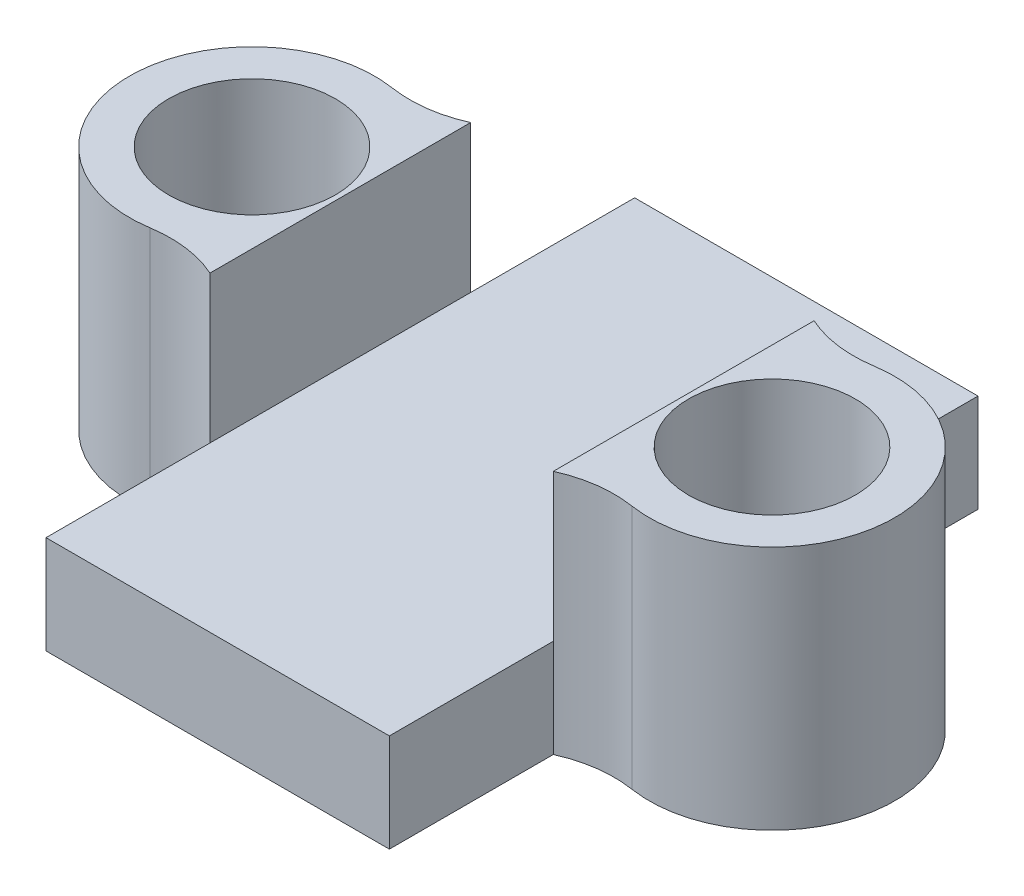
ISO-10303-21;
HEADER;
FILE_DESCRIPTION(('STEP AP214'),'2;1');
FILE_NAME('part.step','',(''),(''),'','','');
FILE_SCHEMA(('AUTOMOTIVE_DESIGN { 1 0 10303 214 1 1 1 1 }'));
ENDSEC;
DATA;
#1=APPLICATION_CONTEXT('core data for automotive mechanical design processes');
#2=APPLICATION_PROTOCOL_DEFINITION('international standard','automotive_design',2000,#1);
#3=PRODUCT_CONTEXT('',#1,'mechanical');
#4=PRODUCT('Part','Part','',(#3));
#5=PRODUCT_RELATED_PRODUCT_CATEGORY('part','',(#4));
#6=PRODUCT_DEFINITION_FORMATION('','',#4);
#7=PRODUCT_DEFINITION_CONTEXT('part definition',#1,'design');
#8=PRODUCT_DEFINITION('design','',#6,#7);
#9=PRODUCT_DEFINITION_SHAPE('','',#8);
#10=(LENGTH_UNIT() NAMED_UNIT(*) SI_UNIT(.MILLI.,.METRE.));
#11=(NAMED_UNIT(*) PLANE_ANGLE_UNIT() SI_UNIT($,.RADIAN.));
#12=(NAMED_UNIT(*) SI_UNIT($,.STERADIAN.) SOLID_ANGLE_UNIT());
#13=UNCERTAINTY_MEASURE_WITH_UNIT(LENGTH_MEASURE(1.E-05),#10,'distance_accuracy_value','');
#14=(GEOMETRIC_REPRESENTATION_CONTEXT(3) GLOBAL_UNCERTAINTY_ASSIGNED_CONTEXT((#13)) GLOBAL_UNIT_ASSIGNED_CONTEXT((#10,
#11,#12)) REPRESENTATION_CONTEXT('',''));
#15=CARTESIAN_POINT('',(0.,0.,0.));
#16=DIRECTION('',(0.,0.,1.));
#17=DIRECTION('',(1.,0.,0.));
#18=AXIS2_PLACEMENT_3D('',#15,#16,#17);
#19=CARTESIAN_POINT('',(4.52192962377324,2.,-4.93908964179011));
#20=DIRECTION('',(0.,1.,0.));
#21=DIRECTION('',(0.,0.,1.));
#22=AXIS2_PLACEMENT_3D('',#19,#20,#21);
#23=PLANE('',#22);
#24=DIRECTION('',(0.,0.,1.));
#25=VECTOR('',#24,1.);
#26=CARTESIAN_POINT('',(-3.5,2.,-6.));
#27=LINE('',#26,#25);
#28=CARTESIAN_POINT('',(-3.5,2.,-6.));
#29=VERTEX_POINT('',#28);
#30=CARTESIAN_POINT('',(-3.5,2.,-2.65749812619081));
#31=VERTEX_POINT('',#30);
#32=EDGE_CURVE('E138',#29,#31,#27,.T.);
#33=ORIENTED_EDGE('',*,*,#32,.T.);
#34=DIRECTION('',(0.,0.,-1.));
#35=VECTOR('',#34,1.);
#36=CARTESIAN_POINT('',(-3.5,2.,0.));
#37=LINE('',#36,#35);
#38=CARTESIAN_POINT('',(-3.5,2.,2.65749812619081));
#39=VERTEX_POINT('',#38);
#40=EDGE_CURVE('E133',#39,#31,#37,.T.);
#41=ORIENTED_EDGE('',*,*,#40,.F.);
#42=DIRECTION('',(0.,0.,1.));
#43=VECTOR('',#42,1.);
#44=CARTESIAN_POINT('',(-3.5,2.,6.));
#45=LINE('',#44,#43);
#46=CARTESIAN_POINT('',(-3.5,2.,6.));
#47=VERTEX_POINT('',#46);
#48=EDGE_CURVE('E125',#39,#47,#45,.T.);
#49=ORIENTED_EDGE('',*,*,#48,.T.);
#50=DIRECTION('',(1.,0.,0.));
#51=VECTOR('',#50,1.);
#52=CARTESIAN_POINT('',(-3.5,2.,6.));
#53=LINE('',#52,#51);
#54=CARTESIAN_POINT('',(3.5,2.,6.));
#55=VERTEX_POINT('',#54);
#56=EDGE_CURVE('E129',#47,#55,#53,.T.);
#57=ORIENTED_EDGE('',*,*,#56,.T.);
#58=DIRECTION('',(0.,0.,-1.));
#59=VECTOR('',#58,1.);
#60=CARTESIAN_POINT('',(3.5,2.,6.));
#61=LINE('',#60,#59);
#62=CARTESIAN_POINT('',(3.5,2.,2.65749812619081));
#63=VERTEX_POINT('',#62);
#64=EDGE_CURVE('E153',#55,#63,#61,.T.);
#65=ORIENTED_EDGE('',*,*,#64,.T.);
#66=DIRECTION('',(0.,0.,-1.));
#67=VECTOR('',#66,1.);
#68=CARTESIAN_POINT('',(3.5,2.,0.));
#69=LINE('',#68,#67);
#70=CARTESIAN_POINT('',(3.5,2.,-2.65749812619081));
#71=VERTEX_POINT('',#70);
#72=EDGE_CURVE('E245',#63,#71,#69,.T.);
#73=ORIENTED_EDGE('',*,*,#72,.T.);
#74=DIRECTION('',(0.,0.,-1.));
#75=VECTOR('',#74,1.);
#76=CARTESIAN_POINT('',(3.5,2.,-6.));
#77=LINE('',#76,#75);
#78=CARTESIAN_POINT('',(3.5,2.,-6.));
#79=VERTEX_POINT('',#78);
#80=EDGE_CURVE('E182',#71,#79,#77,.T.);
#81=ORIENTED_EDGE('',*,*,#80,.T.);
#82=DIRECTION('',(-1.,0.,0.));
#83=VECTOR('',#82,1.);
#84=CARTESIAN_POINT('',(-3.5,2.,-6.));
#85=LINE('',#84,#83);
#86=EDGE_CURVE('E112',#79,#29,#85,.T.);
#87=ORIENTED_EDGE('',*,*,#86,.T.);
#88=EDGE_LOOP('',(#33,#41,#49,#57,#65,#73,#81,#87));
#89=FACE_BOUND('',#88,.T.);
#90=ADVANCED_FACE('F37',(#89),#23,.T.);
#91=CARTESIAN_POINT('',(4.52192962377324,0.,-4.93908964179011));
#92=DIRECTION('',(0.,1.,0.));
#93=DIRECTION('',(0.,0.,1.));
#94=AXIS2_PLACEMENT_3D('',#91,#92,#93);
#95=PLANE('',#94);
#96=DIRECTION('',(0.,0.,-1.));
#97=VECTOR('',#96,1.);
#98=CARTESIAN_POINT('',(3.5,0.,-6.));
#99=LINE('',#98,#97);
#100=CARTESIAN_POINT('',(3.5,0.,-2.65749812619081));
#101=VERTEX_POINT('',#100);
#102=CARTESIAN_POINT('',(3.5,0.,-6.));
#103=VERTEX_POINT('',#102);
#104=EDGE_CURVE('E159',#101,#103,#99,.T.);
#105=ORIENTED_EDGE('',*,*,#104,.F.);
#106=CARTESIAN_POINT('',(4.52192962377324,0.,-4.93908964179011));
#107=DIRECTION('',(0.,-1.,0.));
#108=DIRECTION('',(0.,0.,1.));
#109=AXIS2_PLACEMENT_3D('',#106,#107,#108);
#110=CIRCLE('',#109,2.5);
#111=CARTESIAN_POINT('',(4.91096481188662,0.,-2.46954482089505));
#112=VERTEX_POINT('',#111);
#113=EDGE_CURVE('E104',#112,#101,#110,.T.);
#114=ORIENTED_EDGE('',*,*,#113,.F.);
#115=CARTESIAN_POINT('',(5.3,0.,0.));
#116=DIRECTION('',(0.,1.,0.));
#117=DIRECTION('',(0.,0.,1.));
#118=AXIS2_PLACEMENT_3D('',#115,#116,#117);
#119=CIRCLE('',#118,2.5);
#120=CARTESIAN_POINT('',(4.91096481188662,0.,2.46954482089505));
#121=VERTEX_POINT('',#120);
#122=EDGE_CURVE('E97',#121,#112,#119,.T.);
#123=ORIENTED_EDGE('',*,*,#122,.F.);
#124=CARTESIAN_POINT('',(4.52192962377324,0.,4.93908964179011));
#125=DIRECTION('',(0.,-1.,0.));
#126=DIRECTION('',(0.,0.,-1.));
#127=AXIS2_PLACEMENT_3D('',#124,#125,#126);
#128=CIRCLE('',#127,2.5);
#129=CARTESIAN_POINT('',(3.5,0.,2.65749812619081));
#130=VERTEX_POINT('',#129);
#131=EDGE_CURVE('E178',#130,#121,#128,.T.);
#132=ORIENTED_EDGE('',*,*,#131,.F.);
#133=DIRECTION('',(0.,0.,-1.));
#134=VECTOR('',#133,1.);
#135=CARTESIAN_POINT('',(3.5,0.,6.));
#136=LINE('',#135,#134);
#137=CARTESIAN_POINT('',(3.5,0.,6.));
#138=VERTEX_POINT('',#137);
#139=EDGE_CURVE('E176',#138,#130,#136,.T.);
#140=ORIENTED_EDGE('',*,*,#139,.F.);
#141=DIRECTION('',(1.,0.,0.));
#142=VECTOR('',#141,1.);
#143=CARTESIAN_POINT('',(-3.5,0.,6.));
#144=LINE('',#143,#142);
#145=CARTESIAN_POINT('',(-3.5,0.,6.));
#146=VERTEX_POINT('',#145);
#147=EDGE_CURVE('E174',#146,#138,#144,.T.);
#148=ORIENTED_EDGE('',*,*,#147,.F.);
#149=DIRECTION('',(0.,0.,1.));
#150=VECTOR('',#149,1.);
#151=CARTESIAN_POINT('',(-3.5,0.,6.));
#152=LINE('',#151,#150);
#153=CARTESIAN_POINT('',(-3.5,0.,2.65749812619081));
#154=VERTEX_POINT('',#153);
#155=EDGE_CURVE('E144',#154,#146,#152,.T.);
#156=ORIENTED_EDGE('',*,*,#155,.F.);
#157=CARTESIAN_POINT('',(-4.52192962377324,0.,4.93908964179011));
#158=DIRECTION('',(0.,-1.,0.));
#159=DIRECTION('',(0.,0.,1.));
#160=AXIS2_PLACEMENT_3D('',#157,#158,#159);
#161=CIRCLE('',#160,2.5);
#162=CARTESIAN_POINT('',(-4.91096481188662,0.,2.46954482089505));
#163=VERTEX_POINT('',#162);
#164=EDGE_CURVE('E171',#163,#154,#161,.T.);
#165=ORIENTED_EDGE('',*,*,#164,.F.);
#166=CARTESIAN_POINT('',(-5.3,0.,0.));
#167=DIRECTION('',(0.,1.,0.));
#168=DIRECTION('',(0.,0.,-1.));
#169=AXIS2_PLACEMENT_3D('',#166,#167,#168);
#170=CIRCLE('',#169,2.5);
#171=CARTESIAN_POINT('',(-4.91096481188662,0.,-2.46954482089505));
#172=VERTEX_POINT('',#171);
#173=EDGE_CURVE('E169',#172,#163,#170,.T.);
#174=ORIENTED_EDGE('',*,*,#173,.F.);
#175=CARTESIAN_POINT('',(-4.52192962377324,0.,-4.93908964179011));
#176=DIRECTION('',(0.,-1.,0.));
#177=DIRECTION('',(0.,0.,-1.));
#178=AXIS2_PLACEMENT_3D('',#175,#176,#177);
#179=CIRCLE('',#178,2.5);
#180=CARTESIAN_POINT('',(-3.5,0.,-2.65749812619081));
#181=VERTEX_POINT('',#180);
#182=EDGE_CURVE('E167',#181,#172,#179,.T.);
#183=ORIENTED_EDGE('',*,*,#182,.F.);
#184=DIRECTION('',(0.,0.,1.));
#185=VECTOR('',#184,1.);
#186=CARTESIAN_POINT('',(-3.5,0.,-6.));
#187=LINE('',#186,#185);
#188=CARTESIAN_POINT('',(-3.5,0.,-6.));
#189=VERTEX_POINT('',#188);
#190=EDGE_CURVE('E165',#189,#181,#187,.T.);
#191=ORIENTED_EDGE('',*,*,#190,.F.);
#192=DIRECTION('',(-1.,0.,0.));
#193=VECTOR('',#192,1.);
#194=CARTESIAN_POINT('',(-3.5,0.,-6.));
#195=LINE('',#194,#193);
#196=EDGE_CURVE('E162',#103,#189,#195,.T.);
#197=ORIENTED_EDGE('',*,*,#196,.F.);
#198=EDGE_LOOP('',(#105,#114,#123,#132,#140,#148,#156,#165,#174,#183,#191,#197));
#199=FACE_BOUND('',#198,.T.);
#200=CARTESIAN_POINT('',(5.3,0.,0.));
#201=DIRECTION('',(0.,1.,0.));
#202=DIRECTION('',(0.,0.,1.));
#203=AXIS2_PLACEMENT_3D('',#200,#201,#202);
#204=CIRCLE('',#203,1.7);
#205=CARTESIAN_POINT('',(5.3,0.,1.7));
#206=VERTEX_POINT('',#205);
#207=EDGE_CURVE('E163',#206,#206,#204,.T.);
#208=ORIENTED_EDGE('',*,*,#207,.T.);
#209=EDGE_LOOP('',(#208));
#210=FACE_BOUND('',#209,.T.);
#211=CARTESIAN_POINT('',(-5.3,0.,0.));
#212=DIRECTION('',(0.,1.,0.));
#213=DIRECTION('',(0.,0.,-1.));
#214=AXIS2_PLACEMENT_3D('',#211,#212,#213);
#215=CIRCLE('',#214,1.7);
#216=CARTESIAN_POINT('',(-5.3,0.,-1.7));
#217=VERTEX_POINT('',#216);
#218=EDGE_CURVE('E265',#217,#217,#215,.T.);
#219=ORIENTED_EDGE('',*,*,#218,.T.);
#220=EDGE_LOOP('',(#219));
#221=FACE_BOUND('',#220,.T.);
#222=ADVANCED_FACE('F210',(#199,#210,#221),#95,.F.);
#223=CARTESIAN_POINT('',(3.5,2.,-6.));
#224=DIRECTION('',(-1.,0.,0.));
#225=DIRECTION('',(0.,0.,1.));
#226=AXIS2_PLACEMENT_3D('',#223,#224,#225);
#227=PLANE('',#226);
#228=ORIENTED_EDGE('',*,*,#104,.T.);
#229=DIRECTION('',(0.,-1.,0.));
#230=VECTOR('',#229,1.);
#231=CARTESIAN_POINT('',(3.5,2.,-6.));
#232=LINE('',#231,#230);
#233=EDGE_CURVE('E11',#79,#103,#232,.T.);
#234=ORIENTED_EDGE('',*,*,#233,.F.);
#235=ORIENTED_EDGE('',*,*,#80,.F.);
#236=DIRECTION('',(0.,-1.,0.));
#237=VECTOR('',#236,1.);
#238=CARTESIAN_POINT('',(3.5,2.,-2.65749812619081));
#239=LINE('',#238,#237);
#240=EDGE_CURVE('E155',#71,#101,#239,.T.);
#241=ORIENTED_EDGE('',*,*,#240,.T.);
#242=EDGE_LOOP('',(#228,#234,#235,#241));
#243=FACE_BOUND('',#242,.T.);
#244=ADVANCED_FACE('F39',(#243),#227,.F.);
#245=CARTESIAN_POINT('',(-3.5,2.,-6.));
#246=DIRECTION('',(0.,0.,1.));
#247=DIRECTION('',(1.,0.,0.));
#248=AXIS2_PLACEMENT_3D('',#245,#246,#247);
#249=PLANE('',#248);
#250=ORIENTED_EDGE('',*,*,#196,.T.);
#251=DIRECTION('',(0.,-1.,0.));
#252=VECTOR('',#251,1.);
#253=CARTESIAN_POINT('',(-3.5,2.,-6.));
#254=LINE('',#253,#252);
#255=EDGE_CURVE('E46',#29,#189,#254,.T.);
#256=ORIENTED_EDGE('',*,*,#255,.F.);
#257=ORIENTED_EDGE('',*,*,#86,.F.);
#258=ORIENTED_EDGE('',*,*,#233,.T.);
#259=EDGE_LOOP('',(#250,#256,#257,#258));
#260=FACE_BOUND('',#259,.T.);
#261=ADVANCED_FACE('F336',(#260),#249,.F.);
#262=CARTESIAN_POINT('',(-3.5,2.,-6.));
#263=DIRECTION('',(1.,0.,0.));
#264=DIRECTION('',(0.,0.,-1.));
#265=AXIS2_PLACEMENT_3D('',#262,#263,#264);
#266=PLANE('',#265);
#267=ORIENTED_EDGE('',*,*,#190,.T.);
#268=DIRECTION('',(0.,-1.,0.));
#269=VECTOR('',#268,1.);
#270=CARTESIAN_POINT('',(-3.5,2.,-2.65749812619081));
#271=LINE('',#270,#269);
#272=EDGE_CURVE('E199',#31,#181,#271,.T.);
#273=ORIENTED_EDGE('',*,*,#272,.F.);
#274=ORIENTED_EDGE('',*,*,#32,.F.);
#275=ORIENTED_EDGE('',*,*,#255,.T.);
#276=EDGE_LOOP('',(#267,#273,#274,#275));
#277=FACE_BOUND('',#276,.T.);
#278=ADVANCED_FACE('F205',(#277),#266,.F.);
#279=CARTESIAN_POINT('',(-4.52192962377324,2.,-4.93908964179011));
#280=DIRECTION('',(0.,-1.,0.));
#281=DIRECTION('',(0.,0.,-1.));
#282=AXIS2_PLACEMENT_3D('',#279,#280,#281);
#283=CYLINDRICAL_SURFACE('',#282,2.5);
#284=ORIENTED_EDGE('',*,*,#182,.T.);
#285=DIRECTION('',(0.,-1.,0.));
#286=VECTOR('',#285,1.);
#287=CARTESIAN_POINT('',(-4.91096481188662,2.,-2.46954482089505));
#288=LINE('',#287,#286);
#289=CARTESIAN_POINT('',(-4.91096481188661,5.,-2.46954482089505));
#290=VERTEX_POINT('',#289);
#291=EDGE_CURVE('E196',#290,#172,#288,.T.);
#292=ORIENTED_EDGE('',*,*,#291,.F.);
#293=CARTESIAN_POINT('',(-4.52192962377324,5.,-4.93908964179011));
#294=DIRECTION('',(0.,1.,0.));
#295=DIRECTION('',(0.,0.,1.));
#296=AXIS2_PLACEMENT_3D('',#293,#294,#295);
#297=CIRCLE('',#296,2.5);
#298=CARTESIAN_POINT('',(-3.5,5.,-2.65749812619081));
#299=VERTEX_POINT('',#298);
#300=EDGE_CURVE('E234',#299,#290,#297,.F.);
#301=ORIENTED_EDGE('',*,*,#300,.F.);
#302=DIRECTION('',(0.,-1.,0.));
#303=VECTOR('',#302,1.);
#304=CARTESIAN_POINT('',(-3.5,5.,-2.65749812619081));
#305=LINE('',#304,#303);
#306=EDGE_CURVE('E233',#299,#31,#305,.T.);
#307=ORIENTED_EDGE('',*,*,#306,.T.);
#308=ORIENTED_EDGE('',*,*,#272,.T.);
#309=EDGE_LOOP('',(#284,#292,#301,#307,#308));
#310=FACE_BOUND('',#309,.T.);
#311=ADVANCED_FACE('F216',(#310),#283,.F.);
#312=CARTESIAN_POINT('',(-5.3,2.,0.));
#313=DIRECTION('',(0.,-1.,0.));
#314=DIRECTION('',(0.,0.,-1.));
#315=AXIS2_PLACEMENT_3D('',#312,#313,#314);
#316=CYLINDRICAL_SURFACE('',#315,2.5);
#317=ORIENTED_EDGE('',*,*,#173,.T.);
#318=DIRECTION('',(0.,-1.,0.));
#319=VECTOR('',#318,1.);
#320=CARTESIAN_POINT('',(-4.91096481188662,2.,2.46954482089505));
#321=LINE('',#320,#319);
#322=CARTESIAN_POINT('',(-4.91096481188662,5.,2.46954482089505));
#323=VERTEX_POINT('',#322);
#324=EDGE_CURVE('E193',#323,#163,#321,.T.);
#325=ORIENTED_EDGE('',*,*,#324,.F.);
#326=CARTESIAN_POINT('',(-5.3,5.,0.));
#327=DIRECTION('',(0.,1.,0.));
#328=DIRECTION('',(0.,0.,1.));
#329=AXIS2_PLACEMENT_3D('',#326,#327,#328);
#330=CIRCLE('',#329,2.5);
#331=EDGE_CURVE('E226',#290,#323,#330,.T.);
#332=ORIENTED_EDGE('',*,*,#331,.F.);
#333=ORIENTED_EDGE('',*,*,#291,.T.);
#334=EDGE_LOOP('',(#317,#325,#332,#333));
#335=FACE_BOUND('',#334,.T.);
#336=ADVANCED_FACE('F223',(#335),#316,.T.);
#337=CARTESIAN_POINT('',(-4.52192962377324,2.,4.93908964179011));
#338=DIRECTION('',(0.,-1.,0.));
#339=DIRECTION('',(0.,0.,-1.));
#340=AXIS2_PLACEMENT_3D('',#337,#338,#339);
#341=CYLINDRICAL_SURFACE('',#340,2.5);
#342=ORIENTED_EDGE('',*,*,#164,.T.);
#343=DIRECTION('',(0.,-1.,0.));
#344=VECTOR('',#343,1.);
#345=CARTESIAN_POINT('',(-3.5,2.,2.65749812619081));
#346=LINE('',#345,#344);
#347=EDGE_CURVE('E147',#39,#154,#346,.T.);
#348=ORIENTED_EDGE('',*,*,#347,.F.);
#349=DIRECTION('',(0.,-1.,0.));
#350=VECTOR('',#349,1.);
#351=CARTESIAN_POINT('',(-3.5,5.,2.65749812619081));
#352=LINE('',#351,#350);
#353=CARTESIAN_POINT('',(-3.5,5.,2.65749812619081));
#354=VERTEX_POINT('',#353);
#355=EDGE_CURVE('E236',#354,#39,#352,.T.);
#356=ORIENTED_EDGE('',*,*,#355,.F.);
#357=CARTESIAN_POINT('',(-4.52192962377324,5.,4.93908964179011));
#358=DIRECTION('',(0.,1.,0.));
#359=DIRECTION('',(0.,0.,1.));
#360=AXIS2_PLACEMENT_3D('',#357,#358,#359);
#361=CIRCLE('',#360,2.5);
#362=EDGE_CURVE('E280',#323,#354,#361,.F.);
#363=ORIENTED_EDGE('',*,*,#362,.F.);
#364=ORIENTED_EDGE('',*,*,#324,.T.);
#365=EDGE_LOOP('',(#342,#348,#356,#363,#364));
#366=FACE_BOUND('',#365,.T.);
#367=ADVANCED_FACE('F327',(#366),#341,.F.);
#368=CARTESIAN_POINT('',(-3.5,2.,6.));
#369=DIRECTION('',(1.,0.,0.));
#370=DIRECTION('',(0.,0.,-1.));
#371=AXIS2_PLACEMENT_3D('',#368,#369,#370);
#372=PLANE('',#371);
#373=ORIENTED_EDGE('',*,*,#155,.T.);
#374=DIRECTION('',(0.,-1.,0.));
#375=VECTOR('',#374,1.);
#376=CARTESIAN_POINT('',(-3.5,2.,6.));
#377=LINE('',#376,#375);
#378=EDGE_CURVE('E141',#47,#146,#377,.T.);
#379=ORIENTED_EDGE('',*,*,#378,.F.);
#380=ORIENTED_EDGE('',*,*,#48,.F.);
#381=ORIENTED_EDGE('',*,*,#347,.T.);
#382=EDGE_LOOP('',(#373,#379,#380,#381));
#383=FACE_BOUND('',#382,.T.);
#384=ADVANCED_FACE('F142',(#383),#372,.F.);
#385=CARTESIAN_POINT('',(-3.5,2.,6.));
#386=DIRECTION('',(0.,0.,-1.));
#387=DIRECTION('',(-1.,0.,0.));
#388=AXIS2_PLACEMENT_3D('',#385,#386,#387);
#389=PLANE('',#388);
#390=ORIENTED_EDGE('',*,*,#147,.T.);
#391=DIRECTION('',(0.,-1.,0.));
#392=VECTOR('',#391,1.);
#393=CARTESIAN_POINT('',(3.5,2.,6.));
#394=LINE('',#393,#392);
#395=EDGE_CURVE('E148',#55,#138,#394,.T.);
#396=ORIENTED_EDGE('',*,*,#395,.F.);
#397=ORIENTED_EDGE('',*,*,#56,.F.);
#398=ORIENTED_EDGE('',*,*,#378,.T.);
#399=EDGE_LOOP('',(#390,#396,#397,#398));
#400=FACE_BOUND('',#399,.T.);
#401=ADVANCED_FACE('F150',(#400),#389,.F.);
#402=CARTESIAN_POINT('',(3.5,2.,6.));
#403=DIRECTION('',(-1.,0.,0.));
#404=DIRECTION('',(0.,0.,1.));
#405=AXIS2_PLACEMENT_3D('',#402,#403,#404);
#406=PLANE('',#405);
#407=ORIENTED_EDGE('',*,*,#139,.T.);
#408=DIRECTION('',(0.,-1.,0.));
#409=VECTOR('',#408,1.);
#410=CARTESIAN_POINT('',(3.5,2.,2.65749812619081));
#411=LINE('',#410,#409);
#412=EDGE_CURVE('E188',#63,#130,#411,.T.);
#413=ORIENTED_EDGE('',*,*,#412,.F.);
#414=ORIENTED_EDGE('',*,*,#64,.F.);
#415=ORIENTED_EDGE('',*,*,#395,.T.);
#416=EDGE_LOOP('',(#407,#413,#414,#415));
#417=FACE_BOUND('',#416,.T.);
#418=ADVANCED_FACE('F318',(#417),#406,.F.);
#419=CARTESIAN_POINT('',(4.52192962377324,2.,4.93908964179011));
#420=DIRECTION('',(0.,-1.,0.));
#421=DIRECTION('',(0.,0.,-1.));
#422=AXIS2_PLACEMENT_3D('',#419,#420,#421);
#423=CYLINDRICAL_SURFACE('',#422,2.5);
#424=ORIENTED_EDGE('',*,*,#131,.T.);
#425=DIRECTION('',(0.,-1.,0.));
#426=VECTOR('',#425,1.);
#427=CARTESIAN_POINT('',(4.91096481188662,2.,2.46954482089505));
#428=LINE('',#427,#426);
#429=CARTESIAN_POINT('',(4.91096481188662,5.,2.46954482089505));
#430=VERTEX_POINT('',#429);
#431=EDGE_CURVE('E186',#430,#121,#428,.T.);
#432=ORIENTED_EDGE('',*,*,#431,.F.);
#433=CARTESIAN_POINT('',(4.52192962377324,5.,4.93908964179011));
#434=DIRECTION('',(0.,1.,0.));
#435=DIRECTION('',(0.,0.,1.));
#436=AXIS2_PLACEMENT_3D('',#433,#434,#435);
#437=CIRCLE('',#436,2.5);
#438=CARTESIAN_POINT('',(3.5,5.,2.65749812619081));
#439=VERTEX_POINT('',#438);
#440=EDGE_CURVE('E248',#439,#430,#437,.F.);
#441=ORIENTED_EDGE('',*,*,#440,.F.);
#442=DIRECTION('',(0.,-1.,0.));
#443=VECTOR('',#442,1.);
#444=CARTESIAN_POINT('',(3.5,5.,2.65749812619081));
#445=LINE('',#444,#443);
#446=EDGE_CURVE('E262',#439,#63,#445,.T.);
#447=ORIENTED_EDGE('',*,*,#446,.T.);
#448=ORIENTED_EDGE('',*,*,#412,.T.);
#449=EDGE_LOOP('',(#424,#432,#441,#447,#448));
#450=FACE_BOUND('',#449,.T.);
#451=ADVANCED_FACE('F315',(#450),#423,.F.);
#452=CARTESIAN_POINT('',(5.3,2.,0.));
#453=DIRECTION('',(0.,-1.,0.));
#454=DIRECTION('',(0.,0.,-1.));
#455=AXIS2_PLACEMENT_3D('',#452,#453,#454);
#456=CYLINDRICAL_SURFACE('',#455,2.5);
#457=ORIENTED_EDGE('',*,*,#122,.T.);
#458=DIRECTION('',(0.,-1.,0.));
#459=VECTOR('',#458,1.);
#460=CARTESIAN_POINT('',(4.91096481188662,2.,-2.46954482089505));
#461=LINE('',#460,#459);
#462=CARTESIAN_POINT('',(4.91096481188662,5.,-2.46954482089505));
#463=VERTEX_POINT('',#462);
#464=EDGE_CURVE('E184',#463,#112,#461,.T.);
#465=ORIENTED_EDGE('',*,*,#464,.F.);
#466=CARTESIAN_POINT('',(5.3,5.,0.));
#467=DIRECTION('',(0.,1.,0.));
#468=DIRECTION('',(0.,0.,1.));
#469=AXIS2_PLACEMENT_3D('',#466,#467,#468);
#470=CIRCLE('',#469,2.5);
#471=EDGE_CURVE('E251',#430,#463,#470,.T.);
#472=ORIENTED_EDGE('',*,*,#471,.F.);
#473=ORIENTED_EDGE('',*,*,#431,.T.);
#474=EDGE_LOOP('',(#457,#465,#472,#473));
#475=FACE_BOUND('',#474,.T.);
#476=ADVANCED_FACE('F312',(#475),#456,.T.);
#477=CARTESIAN_POINT('',(4.52192962377324,2.,-4.93908964179011));
#478=DIRECTION('',(0.,-1.,0.));
#479=DIRECTION('',(0.,0.,-1.));
#480=AXIS2_PLACEMENT_3D('',#477,#478,#479);
#481=CYLINDRICAL_SURFACE('',#480,2.5);
#482=ORIENTED_EDGE('',*,*,#113,.T.);
#483=ORIENTED_EDGE('',*,*,#240,.F.);
#484=DIRECTION('',(0.,-1.,0.));
#485=VECTOR('',#484,1.);
#486=CARTESIAN_POINT('',(3.5,5.,-2.65749812619081));
#487=LINE('',#486,#485);
#488=CARTESIAN_POINT('',(3.5,5.,-2.65749812619081));
#489=VERTEX_POINT('',#488);
#490=EDGE_CURVE('E54',#489,#71,#487,.T.);
#491=ORIENTED_EDGE('',*,*,#490,.F.);
#492=CARTESIAN_POINT('',(4.52192962377324,5.,-4.93908964179011));
#493=DIRECTION('',(0.,1.,0.));
#494=DIRECTION('',(0.,0.,1.));
#495=AXIS2_PLACEMENT_3D('',#492,#493,#494);
#496=CIRCLE('',#495,2.5);
#497=EDGE_CURVE('E254',#463,#489,#496,.F.);
#498=ORIENTED_EDGE('',*,*,#497,.F.);
#499=ORIENTED_EDGE('',*,*,#464,.T.);
#500=EDGE_LOOP('',(#482,#483,#491,#498,#499));
#501=FACE_BOUND('',#500,.T.);
#502=ADVANCED_FACE('F299',(#501),#481,.F.);
#503=CARTESIAN_POINT('',(5.3,2.,0.));
#504=DIRECTION('',(0.,-1.,0.));
#505=DIRECTION('',(0.,0.,-1.));
#506=AXIS2_PLACEMENT_3D('',#503,#504,#505);
#507=CYLINDRICAL_SURFACE('',#506,1.7);
#508=ORIENTED_EDGE('',*,*,#207,.F.);
#509=EDGE_LOOP('',(#508));
#510=FACE_BOUND('',#509,.T.);
#511=CARTESIAN_POINT('',(5.3,5.,0.));
#512=DIRECTION('',(0.,1.,0.));
#513=DIRECTION('',(0.,0.,1.));
#514=AXIS2_PLACEMENT_3D('',#511,#512,#513);
#515=CIRCLE('',#514,1.7);
#516=CARTESIAN_POINT('',(5.3,5.,1.7));
#517=VERTEX_POINT('',#516);
#518=EDGE_CURVE('E257',#517,#517,#515,.F.);
#519=ORIENTED_EDGE('',*,*,#518,.F.);
#520=EDGE_LOOP('',(#519));
#521=FACE_BOUND('',#520,.T.);
#522=ADVANCED_FACE('F290',(#510,#521),#507,.F.);
#523=CARTESIAN_POINT('',(-5.3,2.,0.));
#524=DIRECTION('',(0.,-1.,0.));
#525=DIRECTION('',(0.,0.,-1.));
#526=AXIS2_PLACEMENT_3D('',#523,#524,#525);
#527=CYLINDRICAL_SURFACE('',#526,1.7);
#528=ORIENTED_EDGE('',*,*,#218,.F.);
#529=EDGE_LOOP('',(#528));
#530=FACE_BOUND('',#529,.T.);
#531=CARTESIAN_POINT('',(-5.3,5.,0.));
#532=DIRECTION('',(0.,1.,0.));
#533=DIRECTION('',(0.,0.,1.));
#534=AXIS2_PLACEMENT_3D('',#531,#532,#533);
#535=CIRCLE('',#534,1.7);
#536=CARTESIAN_POINT('',(-5.3,5.,1.7));
#537=VERTEX_POINT('',#536);
#538=EDGE_CURVE('E242',#537,#537,#535,.F.);
#539=ORIENTED_EDGE('',*,*,#538,.F.);
#540=EDGE_LOOP('',(#539));
#541=FACE_BOUND('',#540,.T.);
#542=ADVANCED_FACE('F287',(#530,#541),#527,.F.);
#543=CARTESIAN_POINT('',(3.5,5.,0.));
#544=DIRECTION('',(-1.,0.,0.));
#545=DIRECTION('',(0.,0.,1.));
#546=AXIS2_PLACEMENT_3D('',#543,#544,#545);
#547=PLANE('',#546);
#548=ORIENTED_EDGE('',*,*,#72,.F.);
#549=ORIENTED_EDGE('',*,*,#446,.F.);
#550=DIRECTION('',(0.,0.,-1.));
#551=VECTOR('',#550,1.);
#552=CARTESIAN_POINT('',(3.5,5.,0.));
#553=LINE('',#552,#551);
#554=EDGE_CURVE('E246',#439,#489,#553,.T.);
#555=ORIENTED_EDGE('',*,*,#554,.T.);
#556=ORIENTED_EDGE('',*,*,#490,.T.);
#557=EDGE_LOOP('',(#548,#549,#555,#556));
#558=FACE_BOUND('',#557,.T.);
#559=ADVANCED_FACE('F289',(#558),#547,.T.);
#560=CARTESIAN_POINT('',(0.,5.,0.));
#561=DIRECTION('',(0.,1.,0.));
#562=DIRECTION('',(0.,0.,1.));
#563=AXIS2_PLACEMENT_3D('',#560,#561,#562);
#564=PLANE('',#563);
#565=ORIENTED_EDGE('',*,*,#554,.F.);
#566=ORIENTED_EDGE('',*,*,#440,.T.);
#567=ORIENTED_EDGE('',*,*,#471,.T.);
#568=ORIENTED_EDGE('',*,*,#497,.T.);
#569=EDGE_LOOP('',(#565,#566,#567,#568));
#570=FACE_BOUND('',#569,.T.);
#571=ORIENTED_EDGE('',*,*,#518,.T.);
#572=EDGE_LOOP('',(#571));
#573=FACE_BOUND('',#572,.T.);
#574=ADVANCED_FACE('F297',(#570,#573),#564,.T.);
#575=CARTESIAN_POINT('',(-3.5,5.,0.));
#576=DIRECTION('',(-1.,0.,0.));
#577=DIRECTION('',(0.,0.,1.));
#578=AXIS2_PLACEMENT_3D('',#575,#576,#577);
#579=PLANE('',#578);
#580=ORIENTED_EDGE('',*,*,#40,.T.);
#581=ORIENTED_EDGE('',*,*,#306,.F.);
#582=DIRECTION('',(0.,0.,-1.));
#583=VECTOR('',#582,1.);
#584=CARTESIAN_POINT('',(-3.5,5.,0.));
#585=LINE('',#584,#583);
#586=EDGE_CURVE('E238',#354,#299,#585,.T.);
#587=ORIENTED_EDGE('',*,*,#586,.F.);
#588=ORIENTED_EDGE('',*,*,#355,.T.);
#589=EDGE_LOOP('',(#580,#581,#587,#588));
#590=FACE_BOUND('',#589,.T.);
#591=ADVANCED_FACE('F273',(#590),#579,.F.);
#592=CARTESIAN_POINT('',(0.,5.,0.));
#593=DIRECTION('',(0.,1.,0.));
#594=DIRECTION('',(0.,0.,1.));
#595=AXIS2_PLACEMENT_3D('',#592,#593,#594);
#596=PLANE('',#595);
#597=ORIENTED_EDGE('',*,*,#538,.T.);
#598=EDGE_LOOP('',(#597));
#599=FACE_BOUND('',#598,.T.);
#600=ORIENTED_EDGE('',*,*,#362,.T.);
#601=ORIENTED_EDGE('',*,*,#586,.T.);
#602=ORIENTED_EDGE('',*,*,#300,.T.);
#603=ORIENTED_EDGE('',*,*,#331,.T.);
#604=EDGE_LOOP('',(#600,#601,#602,#603));
#605=FACE_BOUND('',#604,.T.);
#606=ADVANCED_FACE('F279',(#599,#605),#596,.T.);
#607=CLOSED_SHELL('',(#90,#222,#244,#261,#278,#311,#336,#367,#384,#401,#418,#451,#476,#502,#522,
#542,#559,#574,#591,#606));
#608=MANIFOLD_SOLID_BREP('B2',#607);
#609=ADVANCED_BREP_SHAPE_REPRESENTATION('',(#18,#608),#14);
#610=SHAPE_DEFINITION_REPRESENTATION(#9,#609);
ENDSEC;
END-ISO-10303-21;
